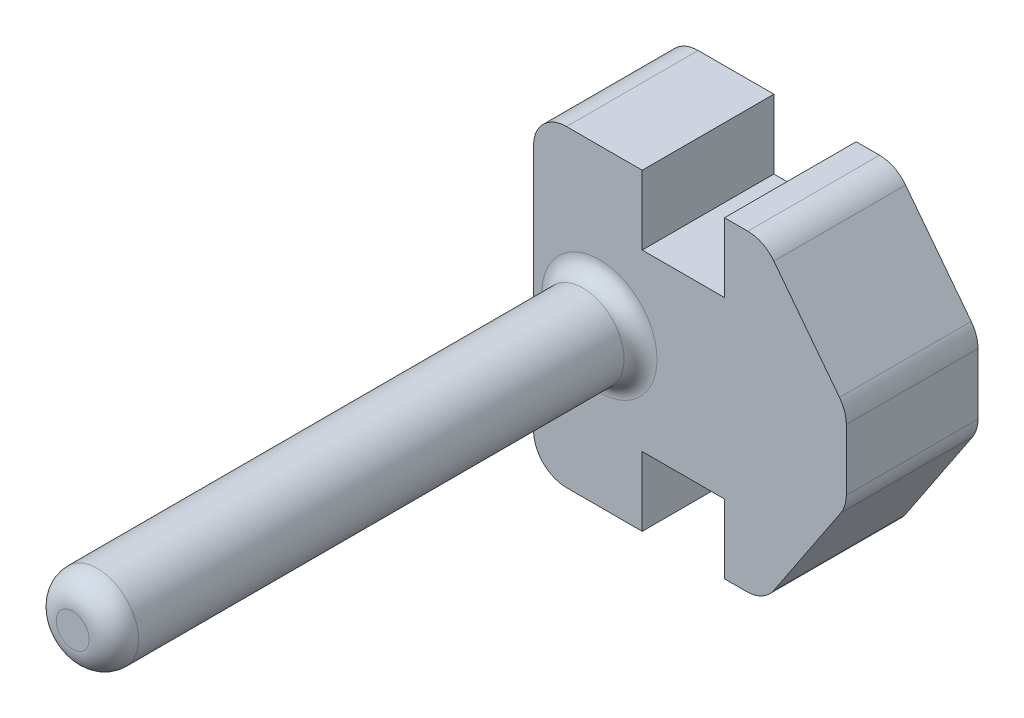
ISO-10303-21;
HEADER;
FILE_DESCRIPTION(('STEP AP214'),'2;1');
FILE_NAME('part.step','',(''),(''),'','','');
FILE_SCHEMA(('AUTOMOTIVE_DESIGN { 1 0 10303 214 1 1 1 1 }'));
ENDSEC;
DATA;
#1=APPLICATION_CONTEXT('core data for automotive mechanical design processes');
#2=APPLICATION_PROTOCOL_DEFINITION('international standard','automotive_design',2000,#1);
#3=PRODUCT_CONTEXT('',#1,'mechanical');
#4=PRODUCT('Part','Part','',(#3));
#5=PRODUCT_RELATED_PRODUCT_CATEGORY('part','',(#4));
#6=PRODUCT_DEFINITION_FORMATION('','',#4);
#7=PRODUCT_DEFINITION_CONTEXT('part definition',#1,'design');
#8=PRODUCT_DEFINITION('design','',#6,#7);
#9=PRODUCT_DEFINITION_SHAPE('','',#8);
#10=(LENGTH_UNIT() NAMED_UNIT(*) SI_UNIT(.MILLI.,.METRE.));
#11=(NAMED_UNIT(*) PLANE_ANGLE_UNIT() SI_UNIT($,.RADIAN.));
#12=(NAMED_UNIT(*) SI_UNIT($,.STERADIAN.) SOLID_ANGLE_UNIT());
#13=UNCERTAINTY_MEASURE_WITH_UNIT(LENGTH_MEASURE(1.E-05),#10,'distance_accuracy_value','');
#14=(GEOMETRIC_REPRESENTATION_CONTEXT(3) GLOBAL_UNCERTAINTY_ASSIGNED_CONTEXT((#13)) GLOBAL_UNIT_ASSIGNED_CONTEXT((#10,
#11,#12)) REPRESENTATION_CONTEXT('',''));
#15=CARTESIAN_POINT('',(0.,0.,0.));
#16=DIRECTION('',(0.,0.,1.));
#17=DIRECTION('',(1.,0.,0.));
#18=AXIS2_PLACEMENT_3D('',#15,#16,#17);
#19=CARTESIAN_POINT('',(2.3,0.,4.));
#20=DIRECTION('',(-1.,0.,0.));
#21=DIRECTION('',(0.,0.,1.));
#22=AXIS2_PLACEMENT_3D('',#19,#20,#21);
#23=PLANE('',#22);
#24=DIRECTION('',(0.,1.,0.));
#25=VECTOR('',#24,1.);
#26=CARTESIAN_POINT('',(2.3,0.,0.));
#27=LINE('',#26,#25);
#28=CARTESIAN_POINT('',(2.3,-4.75,0.));
#29=VERTEX_POINT('',#28);
#30=CARTESIAN_POINT('',(2.3,-2.65,0.));
#31=VERTEX_POINT('',#30);
#32=EDGE_CURVE('E194',#29,#31,#27,.T.);
#33=ORIENTED_EDGE('',*,*,#32,.F.);
#34=DIRECTION('',(0.,0.,-1.));
#35=VECTOR('',#34,1.);
#36=CARTESIAN_POINT('',(2.3,-4.75,4.));
#37=LINE('',#36,#35);
#38=CARTESIAN_POINT('',(2.3,-4.75,4.));
#39=VERTEX_POINT('',#38);
#40=EDGE_CURVE('E181',#39,#29,#37,.T.);
#41=ORIENTED_EDGE('',*,*,#40,.F.);
#42=DIRECTION('',(0.,1.,0.));
#43=VECTOR('',#42,1.);
#44=CARTESIAN_POINT('',(2.3,0.,4.));
#45=LINE('',#44,#43);
#46=CARTESIAN_POINT('',(2.3,-2.65,4.));
#47=VERTEX_POINT('',#46);
#48=EDGE_CURVE('E188',#39,#47,#45,.T.);
#49=ORIENTED_EDGE('',*,*,#48,.T.);
#50=DIRECTION('',(0.,0.,-1.));
#51=VECTOR('',#50,1.);
#52=CARTESIAN_POINT('',(2.3,-2.65,4.));
#53=LINE('',#52,#51);
#54=EDGE_CURVE('E226',#47,#31,#53,.T.);
#55=ORIENTED_EDGE('',*,*,#54,.T.);
#56=EDGE_LOOP('',(#33,#41,#49,#55));
#57=FACE_BOUND('',#56,.T.);
#58=ADVANCED_FACE('F38',(#57),#23,.T.);
#59=CARTESIAN_POINT('',(0.,-4.75,4.));
#60=DIRECTION('',(0.,-1.,0.));
#61=DIRECTION('',(1.,0.,0.));
#62=AXIS2_PLACEMENT_3D('',#59,#60,#61);
#63=PLANE('',#62);
#64=DIRECTION('',(-1.,0.,0.));
#65=VECTOR('',#64,1.);
#66=CARTESIAN_POINT('',(0.,-4.75,0.));
#67=LINE('',#66,#65);
#68=CARTESIAN_POINT('',(2.964816241512,-4.75,0.));
#69=VERTEX_POINT('',#68);
#70=EDGE_CURVE('E228',#69,#29,#67,.T.);
#71=ORIENTED_EDGE('',*,*,#70,.F.);
#72=DIRECTION('',(0.,0.,-1.));
#73=VECTOR('',#72,1.);
#74=CARTESIAN_POINT('',(2.964816241512,-4.75,4.));
#75=LINE('',#74,#73);
#76=CARTESIAN_POINT('',(2.964816241512,-4.75,4.));
#77=VERTEX_POINT('',#76);
#78=EDGE_CURVE('E184',#69,#77,#75,.F.);
#79=ORIENTED_EDGE('',*,*,#78,.T.);
#80=DIRECTION('',(-1.,0.,0.));
#81=VECTOR('',#80,1.);
#82=CARTESIAN_POINT('',(0.,-4.75,4.));
#83=LINE('',#82,#81);
#84=EDGE_CURVE('E177',#77,#39,#83,.T.);
#85=ORIENTED_EDGE('',*,*,#84,.T.);
#86=ORIENTED_EDGE('',*,*,#40,.T.);
#87=EDGE_LOOP('',(#71,#79,#85,#86));
#88=FACE_BOUND('',#87,.T.);
#89=ADVANCED_FACE('F180',(#88),#63,.T.);
#90=CARTESIAN_POINT('',(0.,4.75,4.));
#91=DIRECTION('',(0.,-1.,0.));
#92=DIRECTION('',(0.,0.,-1.));
#93=AXIS2_PLACEMENT_3D('',#90,#91,#92);
#94=PLANE('',#93);
#95=DIRECTION('',(-1.,0.,0.));
#96=VECTOR('',#95,1.);
#97=CARTESIAN_POINT('',(0.,4.75,4.));
#98=LINE('',#97,#96);
#99=CARTESIAN_POINT('',(3.00759850254948,4.75,4.));
#100=VERTEX_POINT('',#99);
#101=CARTESIAN_POINT('',(2.3,4.75,4.));
#102=VERTEX_POINT('',#101);
#103=EDGE_CURVE('E187',#100,#102,#98,.T.);
#104=ORIENTED_EDGE('',*,*,#103,.F.);
#105=DIRECTION('',(0.,0.,-1.));
#106=VECTOR('',#105,1.);
#107=CARTESIAN_POINT('',(3.00759850254948,4.75,0.));
#108=LINE('',#107,#106);
#109=CARTESIAN_POINT('',(3.00759850254948,4.75,0.));
#110=VERTEX_POINT('',#109);
#111=EDGE_CURVE('E299',#100,#110,#108,.T.);
#112=ORIENTED_EDGE('',*,*,#111,.T.);
#113=DIRECTION('',(-1.,0.,0.));
#114=VECTOR('',#113,1.);
#115=CARTESIAN_POINT('',(0.,4.75,0.));
#116=LINE('',#115,#114);
#117=CARTESIAN_POINT('',(2.3,4.75,0.));
#118=VERTEX_POINT('',#117);
#119=EDGE_CURVE('E231',#110,#118,#116,.T.);
#120=ORIENTED_EDGE('',*,*,#119,.T.);
#121=DIRECTION('',(0.,0.,-1.));
#122=VECTOR('',#121,1.);
#123=CARTESIAN_POINT('',(2.3,4.75,4.));
#124=LINE('',#123,#122);
#125=EDGE_CURVE('E196',#102,#118,#124,.T.);
#126=ORIENTED_EDGE('',*,*,#125,.F.);
#127=EDGE_LOOP('',(#104,#112,#120,#126));
#128=FACE_BOUND('',#127,.T.);
#129=ADVANCED_FACE('F336',(#128),#94,.F.);
#130=CARTESIAN_POINT('',(2.3,0.,4.));
#131=DIRECTION('',(1.,0.,0.));
#132=DIRECTION('',(0.,1.,0.));
#133=AXIS2_PLACEMENT_3D('',#130,#131,#132);
#134=PLANE('',#133);
#135=DIRECTION('',(0.,-1.,0.));
#136=VECTOR('',#135,1.);
#137=CARTESIAN_POINT('',(2.3,0.,0.));
#138=LINE('',#137,#136);
#139=CARTESIAN_POINT('',(2.3,2.65,0.));
#140=VERTEX_POINT('',#139);
#141=EDGE_CURVE('E234',#118,#140,#138,.T.);
#142=ORIENTED_EDGE('',*,*,#141,.T.);
#143=DIRECTION('',(0.,0.,-1.));
#144=VECTOR('',#143,1.);
#145=CARTESIAN_POINT('',(2.3,2.65,4.));
#146=LINE('',#145,#144);
#147=CARTESIAN_POINT('',(2.3,2.65,4.));
#148=VERTEX_POINT('',#147);
#149=EDGE_CURVE('E258',#148,#140,#146,.T.);
#150=ORIENTED_EDGE('',*,*,#149,.F.);
#151=DIRECTION('',(0.,-1.,0.));
#152=VECTOR('',#151,1.);
#153=CARTESIAN_POINT('',(2.3,0.,4.));
#154=LINE('',#153,#152);
#155=EDGE_CURVE('E212',#102,#148,#154,.T.);
#156=ORIENTED_EDGE('',*,*,#155,.F.);
#157=ORIENTED_EDGE('',*,*,#125,.T.);
#158=EDGE_LOOP('',(#142,#150,#156,#157));
#159=FACE_BOUND('',#158,.T.);
#160=ADVANCED_FACE('F341',(#159),#134,.F.);
#161=CARTESIAN_POINT('',(0.,2.65,4.));
#162=DIRECTION('',(0.,1.,0.));
#163=DIRECTION('',(0.,0.,1.));
#164=AXIS2_PLACEMENT_3D('',#161,#162,#163);
#165=PLANE('',#164);
#166=DIRECTION('',(1.,0.,0.));
#167=VECTOR('',#166,1.);
#168=CARTESIAN_POINT('',(0.,2.65,0.));
#169=LINE('',#168,#167);
#170=CARTESIAN_POINT('',(-0.2,2.65,0.));
#171=VERTEX_POINT('',#170);
#172=EDGE_CURVE('E238',#171,#140,#169,.T.);
#173=ORIENTED_EDGE('',*,*,#172,.F.);
#174=DIRECTION('',(0.,0.,-1.));
#175=VECTOR('',#174,1.);
#176=CARTESIAN_POINT('',(-0.2,2.65,4.));
#177=LINE('',#176,#175);
#178=CARTESIAN_POINT('',(-0.2,2.65,4.));
#179=VERTEX_POINT('',#178);
#180=EDGE_CURVE('E256',#179,#171,#177,.T.);
#181=ORIENTED_EDGE('',*,*,#180,.F.);
#182=DIRECTION('',(1.,0.,0.));
#183=VECTOR('',#182,1.);
#184=CARTESIAN_POINT('',(0.,2.65,4.));
#185=LINE('',#184,#183);
#186=EDGE_CURVE('E215',#179,#148,#185,.T.);
#187=ORIENTED_EDGE('',*,*,#186,.T.);
#188=ORIENTED_EDGE('',*,*,#149,.T.);
#189=EDGE_LOOP('',(#173,#181,#187,#188));
#190=FACE_BOUND('',#189,.T.);
#191=ADVANCED_FACE('F437',(#190),#165,.T.);
#192=CARTESIAN_POINT('',(-0.2,0.,4.));
#193=DIRECTION('',(1.,0.,0.));
#194=DIRECTION('',(0.,1.,0.));
#195=AXIS2_PLACEMENT_3D('',#192,#193,#194);
#196=PLANE('',#195);
#197=DIRECTION('',(0.,-1.,0.));
#198=VECTOR('',#197,1.);
#199=CARTESIAN_POINT('',(-0.2,0.,0.));
#200=LINE('',#199,#198);
#201=CARTESIAN_POINT('',(-0.2,4.75,0.));
#202=VERTEX_POINT('',#201);
#203=EDGE_CURVE('E241',#202,#171,#200,.T.);
#204=ORIENTED_EDGE('',*,*,#203,.F.);
#205=DIRECTION('',(0.,0.,-1.));
#206=VECTOR('',#205,1.);
#207=CARTESIAN_POINT('',(-0.2,4.75,4.));
#208=LINE('',#207,#206);
#209=CARTESIAN_POINT('',(-0.2,4.75,4.));
#210=VERTEX_POINT('',#209);
#211=EDGE_CURVE('E254',#210,#202,#208,.T.);
#212=ORIENTED_EDGE('',*,*,#211,.F.);
#213=DIRECTION('',(0.,-1.,0.));
#214=VECTOR('',#213,1.);
#215=CARTESIAN_POINT('',(-0.2,0.,4.));
#216=LINE('',#215,#214);
#217=EDGE_CURVE('E218',#210,#179,#216,.T.);
#218=ORIENTED_EDGE('',*,*,#217,.T.);
#219=ORIENTED_EDGE('',*,*,#180,.T.);
#220=EDGE_LOOP('',(#204,#212,#218,#219));
#221=FACE_BOUND('',#220,.T.);
#222=ADVANCED_FACE('F432',(#221),#196,.T.);
#223=CARTESIAN_POINT('',(-2.5,4.75,0.));
#224=VERTEX_POINT('',#223);
#225=EDGE_CURVE('E235',#202,#224,#116,.T.);
#226=ORIENTED_EDGE('',*,*,#225,.T.);
#227=DIRECTION('',(0.,0.,-1.));
#228=VECTOR('',#227,1.);
#229=CARTESIAN_POINT('',(-2.5,4.75,4.));
#230=LINE('',#229,#228);
#231=CARTESIAN_POINT('',(-2.5,4.75,4.));
#232=VERTEX_POINT('',#231);
#233=EDGE_CURVE('E310',#224,#232,#230,.F.);
#234=ORIENTED_EDGE('',*,*,#233,.T.);
#235=EDGE_CURVE('E213',#210,#232,#98,.T.);
#236=ORIENTED_EDGE('',*,*,#235,.F.);
#237=ORIENTED_EDGE('',*,*,#211,.T.);
#238=EDGE_LOOP('',(#226,#234,#236,#237));
#239=FACE_BOUND('',#238,.T.);
#240=ADVANCED_FACE('F436',(#239),#94,.F.);
#241=CARTESIAN_POINT('',(-3.5,0.,4.));
#242=DIRECTION('',(-1.,0.,0.));
#243=DIRECTION('',(0.,0.,1.));
#244=AXIS2_PLACEMENT_3D('',#241,#242,#243);
#245=PLANE('',#244);
#246=DIRECTION('',(0.,1.,0.));
#247=VECTOR('',#246,1.);
#248=CARTESIAN_POINT('',(-3.5,0.,0.));
#249=LINE('',#248,#247);
#250=CARTESIAN_POINT('',(-3.5,-3.75,0.));
#251=VERTEX_POINT('',#250);
#252=CARTESIAN_POINT('',(-3.5,3.75,0.));
#253=VERTEX_POINT('',#252);
#254=EDGE_CURVE('E244',#251,#253,#249,.T.);
#255=ORIENTED_EDGE('',*,*,#254,.F.);
#256=DIRECTION('',(0.,0.,-1.));
#257=VECTOR('',#256,1.);
#258=CARTESIAN_POINT('',(-3.5,-3.75,4.));
#259=LINE('',#258,#257);
#260=CARTESIAN_POINT('',(-3.5,-3.75,4.));
#261=VERTEX_POINT('',#260);
#262=EDGE_CURVE('E308',#251,#261,#259,.F.);
#263=ORIENTED_EDGE('',*,*,#262,.T.);
#264=DIRECTION('',(0.,1.,0.));
#265=VECTOR('',#264,1.);
#266=CARTESIAN_POINT('',(-3.5,0.,4.));
#267=LINE('',#266,#265);
#268=CARTESIAN_POINT('',(-3.5,3.75,4.));
#269=VERTEX_POINT('',#268);
#270=EDGE_CURVE('E221',#261,#269,#267,.T.);
#271=ORIENTED_EDGE('',*,*,#270,.T.);
#272=DIRECTION('',(0.,0.,-1.));
#273=VECTOR('',#272,1.);
#274=CARTESIAN_POINT('',(-3.5,3.75,0.));
#275=LINE('',#274,#273);
#276=EDGE_CURVE('E305',#269,#253,#275,.T.);
#277=ORIENTED_EDGE('',*,*,#276,.T.);
#278=EDGE_LOOP('',(#255,#263,#271,#277));
#279=FACE_BOUND('',#278,.T.);
#280=ADVANCED_FACE('F371',(#279),#245,.T.);
#281=CARTESIAN_POINT('',(-0.200000000000001,-4.75,4.));
#282=VERTEX_POINT('',#281);
#283=CARTESIAN_POINT('',(-2.5,-4.75,4.));
#284=VERTEX_POINT('',#283);
#285=EDGE_CURVE('E190',#282,#284,#83,.T.);
#286=ORIENTED_EDGE('',*,*,#285,.T.);
#287=DIRECTION('',(0.,0.,-1.));
#288=VECTOR('',#287,1.);
#289=CARTESIAN_POINT('',(-2.5,-4.75,4.));
#290=LINE('',#289,#288);
#291=CARTESIAN_POINT('',(-2.5,-4.75,0.));
#292=VERTEX_POINT('',#291);
#293=EDGE_CURVE('E302',#284,#292,#290,.T.);
#294=ORIENTED_EDGE('',*,*,#293,.T.);
#295=CARTESIAN_POINT('',(-0.200000000000001,-4.75,0.));
#296=VERTEX_POINT('',#295);
#297=EDGE_CURVE('E232',#296,#292,#67,.T.);
#298=ORIENTED_EDGE('',*,*,#297,.F.);
#299=DIRECTION('',(0.,0.,-1.));
#300=VECTOR('',#299,1.);
#301=CARTESIAN_POINT('',(-0.200000000000001,-4.75,4.));
#302=LINE('',#301,#300);
#303=EDGE_CURVE('E252',#282,#296,#302,.T.);
#304=ORIENTED_EDGE('',*,*,#303,.F.);
#305=EDGE_LOOP('',(#286,#294,#298,#304));
#306=FACE_BOUND('',#305,.T.);
#307=ADVANCED_FACE('F338',(#306),#63,.T.);
#308=CARTESIAN_POINT('',(-0.200000000000001,0.,4.));
#309=DIRECTION('',(-1.,0.,0.));
#310=DIRECTION('',(0.,0.,1.));
#311=AXIS2_PLACEMENT_3D('',#308,#309,#310);
#312=PLANE('',#311);
#313=DIRECTION('',(0.,1.,0.));
#314=VECTOR('',#313,1.);
#315=CARTESIAN_POINT('',(-0.200000000000001,0.,0.));
#316=LINE('',#315,#314);
#317=CARTESIAN_POINT('',(-0.200000000000001,-2.65,0.));
#318=VERTEX_POINT('',#317);
#319=EDGE_CURVE('E205',#296,#318,#316,.T.);
#320=ORIENTED_EDGE('',*,*,#319,.T.);
#321=DIRECTION('',(0.,0.,-1.));
#322=VECTOR('',#321,1.);
#323=CARTESIAN_POINT('',(-0.200000000000001,-2.65,4.));
#324=LINE('',#323,#322);
#325=CARTESIAN_POINT('',(-0.200000000000001,-2.65,4.));
#326=VERTEX_POINT('',#325);
#327=EDGE_CURVE('E249',#326,#318,#324,.T.);
#328=ORIENTED_EDGE('',*,*,#327,.F.);
#329=DIRECTION('',(0.,1.,0.));
#330=VECTOR('',#329,1.);
#331=CARTESIAN_POINT('',(-0.200000000000001,0.,4.));
#332=LINE('',#331,#330);
#333=EDGE_CURVE('E223',#282,#326,#332,.T.);
#334=ORIENTED_EDGE('',*,*,#333,.F.);
#335=ORIENTED_EDGE('',*,*,#303,.T.);
#336=EDGE_LOOP('',(#320,#328,#334,#335));
#337=FACE_BOUND('',#336,.T.);
#338=ADVANCED_FACE('F386',(#337),#312,.F.);
#339=CARTESIAN_POINT('',(0.,-2.65,4.));
#340=DIRECTION('',(0.,1.,0.));
#341=DIRECTION('',(0.,0.,1.));
#342=AXIS2_PLACEMENT_3D('',#339,#340,#341);
#343=PLANE('',#342);
#344=DIRECTION('',(1.,0.,0.));
#345=VECTOR('',#344,1.);
#346=CARTESIAN_POINT('',(0.,-2.65,0.));
#347=LINE('',#346,#345);
#348=EDGE_CURVE('E202',#318,#31,#347,.T.);
#349=ORIENTED_EDGE('',*,*,#348,.T.);
#350=ORIENTED_EDGE('',*,*,#54,.F.);
#351=DIRECTION('',(1.,0.,0.));
#352=VECTOR('',#351,1.);
#353=CARTESIAN_POINT('',(0.,-2.65,4.));
#354=LINE('',#353,#352);
#355=EDGE_CURVE('E200',#326,#47,#354,.T.);
#356=ORIENTED_EDGE('',*,*,#355,.F.);
#357=ORIENTED_EDGE('',*,*,#327,.T.);
#358=EDGE_LOOP('',(#349,#350,#356,#357));
#359=FACE_BOUND('',#358,.T.);
#360=ADVANCED_FACE('F389',(#359),#343,.F.);
#361=CARTESIAN_POINT('',(0.,0.,4.));
#362=DIRECTION('',(0.,0.,1.));
#363=DIRECTION('',(1.,0.,0.));
#364=AXIS2_PLACEMENT_3D('',#361,#362,#363);
#365=PLANE('',#364);
#366=CARTESIAN_POINT('',(-1.5,0.,4.));
#367=DIRECTION('',(0.,0.,1.));
#368=DIRECTION('',(1.,0.,0.));
#369=AXIS2_PLACEMENT_3D('',#366,#367,#368);
#370=CIRCLE('',#369,1.75);
#371=CARTESIAN_POINT('',(0.25,0.,4.));
#372=VERTEX_POINT('',#371);
#373=EDGE_CURVE('E315',#372,#372,#370,.F.);
#374=ORIENTED_EDGE('',*,*,#373,.T.);
#375=EDGE_LOOP('',(#374));
#376=FACE_BOUND('',#375,.T.);
#377=ORIENTED_EDGE('',*,*,#84,.F.);
#378=CARTESIAN_POINT('',(2.964816241512,-3.75,4.));
#379=DIRECTION('',(0.,0.,1.));
#380=DIRECTION('',(1.,0.,0.));
#381=AXIS2_PLACEMENT_3D('',#378,#379,#380);
#382=CIRCLE('',#381,1.);
#383=CARTESIAN_POINT('',(3.79686653584985,-4.30470019622523,4.));
#384=VERTEX_POINT('',#383);
#385=EDGE_CURVE('E287',#77,#384,#382,.T.);
#386=ORIENTED_EDGE('',*,*,#385,.T.);
#387=DIRECTION('',(-0.554700196225229,-0.832050294337844,0.));
#388=VECTOR('',#387,1.);
#389=CARTESIAN_POINT('',(4.61538461538461,-3.07692307692308,4.));
#390=LINE('',#389,#388);
#391=CARTESIAN_POINT('',(5.83205029433784,-1.25192455849323,4.));
#392=VERTEX_POINT('',#391);
#393=EDGE_CURVE('E393',#392,#384,#390,.T.);
#394=ORIENTED_EDGE('',*,*,#393,.F.);
#395=CARTESIAN_POINT('',(5.,-0.697224362268005,4.));
#396=DIRECTION('',(0.,0.,1.));
#397=DIRECTION('',(1.,0.,0.));
#398=AXIS2_PLACEMENT_3D('',#395,#396,#397);
#399=CIRCLE('',#398,1.);
#400=CARTESIAN_POINT('',(6.,-0.697224362268004,4.));
#401=VERTEX_POINT('',#400);
#402=EDGE_CURVE('E285',#392,#401,#399,.T.);
#403=ORIENTED_EDGE('',*,*,#402,.T.);
#404=DIRECTION('',(0.,-1.,0.));
#405=VECTOR('',#404,1.);
#406=CARTESIAN_POINT('',(6.,0.,4.));
#407=LINE('',#406,#405);
#408=CARTESIAN_POINT('',(6.,1.15987805331433,4.));
#409=VERTEX_POINT('',#408);
#410=EDGE_CURVE('E399',#409,#401,#407,.T.);
#411=ORIENTED_EDGE('',*,*,#410,.F.);
#412=CARTESIAN_POINT('',(5.,1.15987805331433,4.));
#413=DIRECTION('',(0.,0.,1.));
#414=DIRECTION('',(1.,0.,0.));
#415=AXIS2_PLACEMENT_3D('',#412,#413,#414);
#416=CIRCLE('',#415,1.);
#417=CARTESIAN_POINT('',(5.7926239891046,1.76958881416402,4.));
#418=VERTEX_POINT('',#417);
#419=EDGE_CURVE('E283',#409,#418,#416,.T.);
#420=ORIENTED_EDGE('',*,*,#419,.T.);
#421=DIRECTION('',(0.609710760849692,-0.7926239891046,0.));
#422=VECTOR('',#421,1.);
#423=CARTESIAN_POINT('',(4.49442379182156,3.45724907063197,4.));
#424=LINE('',#423,#422);
#425=CARTESIAN_POINT('',(3.80022249165408,4.35971076084969,4.));
#426=VERTEX_POINT('',#425);
#427=EDGE_CURVE('E229',#426,#418,#424,.T.);
#428=ORIENTED_EDGE('',*,*,#427,.F.);
#429=CARTESIAN_POINT('',(3.00759850254948,3.75,4.));
#430=DIRECTION('',(0.,0.,1.));
#431=DIRECTION('',(1.,0.,0.));
#432=AXIS2_PLACEMENT_3D('',#429,#430,#431);
#433=CIRCLE('',#432,1.);
#434=EDGE_CURVE('E281',#426,#100,#433,.T.);
#435=ORIENTED_EDGE('',*,*,#434,.T.);
#436=ORIENTED_EDGE('',*,*,#103,.T.);
#437=ORIENTED_EDGE('',*,*,#155,.T.);
#438=ORIENTED_EDGE('',*,*,#186,.F.);
#439=ORIENTED_EDGE('',*,*,#217,.F.);
#440=ORIENTED_EDGE('',*,*,#235,.T.);
#441=CARTESIAN_POINT('',(-2.5,3.75,4.));
#442=DIRECTION('',(0.,0.,1.));
#443=DIRECTION('',(1.,0.,0.));
#444=AXIS2_PLACEMENT_3D('',#441,#442,#443);
#445=CIRCLE('',#444,1.);
#446=EDGE_CURVE('E59',#232,#269,#445,.T.);
#447=ORIENTED_EDGE('',*,*,#446,.T.);
#448=ORIENTED_EDGE('',*,*,#270,.F.);
#449=CARTESIAN_POINT('',(-2.5,-3.75,4.));
#450=DIRECTION('',(0.,0.,1.));
#451=DIRECTION('',(1.,0.,0.));
#452=AXIS2_PLACEMENT_3D('',#449,#450,#451);
#453=CIRCLE('',#452,1.);
#454=EDGE_CURVE('E53',#261,#284,#453,.T.);
#455=ORIENTED_EDGE('',*,*,#454,.T.);
#456=ORIENTED_EDGE('',*,*,#285,.F.);
#457=ORIENTED_EDGE('',*,*,#333,.T.);
#458=ORIENTED_EDGE('',*,*,#355,.T.);
#459=ORIENTED_EDGE('',*,*,#48,.F.);
#460=EDGE_LOOP('',(#377,#386,#394,#403,#411,#420,#428,#435,#436,#437,#438,#439,#440,#447,#448,
#455,#456,#457,#458,#459));
#461=FACE_BOUND('',#460,.T.);
#462=ADVANCED_FACE('F198',(#376,#461),#365,.T.);
#463=CARTESIAN_POINT('',(0.,0.,0.));
#464=DIRECTION('',(0.,0.,1.));
#465=DIRECTION('',(1.,0.,0.));
#466=AXIS2_PLACEMENT_3D('',#463,#464,#465);
#467=PLANE('',#466);
#468=DIRECTION('',(-0.554700196225229,-0.832050294337844,0.));
#469=VECTOR('',#468,1.);
#470=CARTESIAN_POINT('',(4.61538461538461,-3.07692307692308,0.));
#471=LINE('',#470,#469);
#472=CARTESIAN_POINT('',(5.83205029433784,-1.25192455849323,0.));
#473=VERTEX_POINT('',#472);
#474=CARTESIAN_POINT('',(3.79686653584985,-4.30470019622523,0.));
#475=VERTEX_POINT('',#474);
#476=EDGE_CURVE('E408',#473,#475,#471,.T.);
#477=ORIENTED_EDGE('',*,*,#476,.T.);
#478=CARTESIAN_POINT('',(2.964816241512,-3.75,0.));
#479=DIRECTION('',(0.,0.,1.));
#480=DIRECTION('',(1.,0.,0.));
#481=AXIS2_PLACEMENT_3D('',#478,#479,#480);
#482=CIRCLE('',#481,1.);
#483=EDGE_CURVE('E276',#475,#69,#482,.F.);
#484=ORIENTED_EDGE('',*,*,#483,.T.);
#485=ORIENTED_EDGE('',*,*,#70,.T.);
#486=ORIENTED_EDGE('',*,*,#32,.T.);
#487=ORIENTED_EDGE('',*,*,#348,.F.);
#488=ORIENTED_EDGE('',*,*,#319,.F.);
#489=ORIENTED_EDGE('',*,*,#297,.T.);
#490=CARTESIAN_POINT('',(-2.5,-3.75,0.));
#491=DIRECTION('',(0.,0.,1.));
#492=DIRECTION('',(1.,0.,0.));
#493=AXIS2_PLACEMENT_3D('',#490,#491,#492);
#494=CIRCLE('',#493,1.);
#495=EDGE_CURVE('E268',#292,#251,#494,.F.);
#496=ORIENTED_EDGE('',*,*,#495,.T.);
#497=ORIENTED_EDGE('',*,*,#254,.T.);
#498=CARTESIAN_POINT('',(-2.5,3.75,0.));
#499=DIRECTION('',(0.,0.,1.));
#500=DIRECTION('',(1.,0.,0.));
#501=AXIS2_PLACEMENT_3D('',#498,#499,#500);
#502=CIRCLE('',#501,1.);
#503=EDGE_CURVE('E266',#253,#224,#502,.F.);
#504=ORIENTED_EDGE('',*,*,#503,.T.);
#505=ORIENTED_EDGE('',*,*,#225,.F.);
#506=ORIENTED_EDGE('',*,*,#203,.T.);
#507=ORIENTED_EDGE('',*,*,#172,.T.);
#508=ORIENTED_EDGE('',*,*,#141,.F.);
#509=ORIENTED_EDGE('',*,*,#119,.F.);
#510=CARTESIAN_POINT('',(3.00759850254948,3.75,0.));
#511=DIRECTION('',(0.,0.,1.));
#512=DIRECTION('',(1.,0.,0.));
#513=AXIS2_PLACEMENT_3D('',#510,#511,#512);
#514=CIRCLE('',#513,1.);
#515=CARTESIAN_POINT('',(3.80022249165408,4.35971076084969,0.));
#516=VERTEX_POINT('',#515);
#517=EDGE_CURVE('E270',#110,#516,#514,.F.);
#518=ORIENTED_EDGE('',*,*,#517,.T.);
#519=DIRECTION('',(0.609710760849692,-0.7926239891046,0.));
#520=VECTOR('',#519,1.);
#521=CARTESIAN_POINT('',(4.49442379182156,3.45724907063197,0.));
#522=LINE('',#521,#520);
#523=CARTESIAN_POINT('',(5.7926239891046,1.76958881416402,0.));
#524=VERTEX_POINT('',#523);
#525=EDGE_CURVE('E208',#516,#524,#522,.T.);
#526=ORIENTED_EDGE('',*,*,#525,.T.);
#527=CARTESIAN_POINT('',(5.,1.15987805331433,0.));
#528=DIRECTION('',(0.,0.,1.));
#529=DIRECTION('',(1.,0.,0.));
#530=AXIS2_PLACEMENT_3D('',#527,#528,#529);
#531=CIRCLE('',#530,1.);
#532=CARTESIAN_POINT('',(6.,1.15987805331433,0.));
#533=VERTEX_POINT('',#532);
#534=EDGE_CURVE('E272',#524,#533,#531,.F.);
#535=ORIENTED_EDGE('',*,*,#534,.T.);
#536=DIRECTION('',(0.,-1.,0.));
#537=VECTOR('',#536,1.);
#538=CARTESIAN_POINT('',(6.,0.,0.));
#539=LINE('',#538,#537);
#540=CARTESIAN_POINT('',(6.,-0.697224362268004,0.));
#541=VERTEX_POINT('',#540);
#542=EDGE_CURVE('E406',#533,#541,#539,.T.);
#543=ORIENTED_EDGE('',*,*,#542,.T.);
#544=CARTESIAN_POINT('',(5.,-0.697224362268005,0.));
#545=DIRECTION('',(0.,0.,1.));
#546=DIRECTION('',(1.,0.,0.));
#547=AXIS2_PLACEMENT_3D('',#544,#545,#546);
#548=CIRCLE('',#547,1.);
#549=EDGE_CURVE('E274',#541,#473,#548,.F.);
#550=ORIENTED_EDGE('',*,*,#549,.T.);
#551=EDGE_LOOP('',(#477,#484,#485,#486,#487,#488,#489,#496,#497,#504,#505,#506,#507,#508,#509,
#518,#526,#535,#543,#550));
#552=FACE_BOUND('',#551,.T.);
#553=ADVANCED_FACE('F375',(#552),#467,.F.);
#554=CARTESIAN_POINT('',(6.,0.,4.));
#555=DIRECTION('',(1.,0.,0.));
#556=DIRECTION('',(0.,1.,0.));
#557=AXIS2_PLACEMENT_3D('',#554,#555,#556);
#558=PLANE('',#557);
#559=ORIENTED_EDGE('',*,*,#410,.T.);
#560=DIRECTION('',(0.,0.,-1.));
#561=VECTOR('',#560,1.);
#562=CARTESIAN_POINT('',(6.,-0.697224362268004,4.));
#563=LINE('',#562,#561);
#564=EDGE_CURVE('E291',#401,#541,#563,.T.);
#565=ORIENTED_EDGE('',*,*,#564,.T.);
#566=ORIENTED_EDGE('',*,*,#542,.F.);
#567=DIRECTION('',(0.,0.,-1.));
#568=VECTOR('',#567,1.);
#569=CARTESIAN_POINT('',(6.,1.15987805331433,4.));
#570=LINE('',#569,#568);
#571=EDGE_CURVE('E289',#533,#409,#570,.F.);
#572=ORIENTED_EDGE('',*,*,#571,.T.);
#573=EDGE_LOOP('',(#559,#565,#566,#572));
#574=FACE_BOUND('',#573,.T.);
#575=ADVANCED_FACE('F456',(#574),#558,.T.);
#576=CARTESIAN_POINT('',(4.49442379182156,3.45724907063197,4.));
#577=DIRECTION('',(0.7926239891046,0.609710760849692,0.));
#578=DIRECTION('',(-0.609710760849692,0.7926239891046,0.));
#579=AXIS2_PLACEMENT_3D('',#576,#577,#578);
#580=PLANE('',#579);
#581=ORIENTED_EDGE('',*,*,#427,.T.);
#582=DIRECTION('',(0.,0.,-1.));
#583=VECTOR('',#582,1.);
#584=CARTESIAN_POINT('',(5.7926239891046,1.76958881416402,4.));
#585=LINE('',#584,#583);
#586=EDGE_CURVE('E296',#418,#524,#585,.T.);
#587=ORIENTED_EDGE('',*,*,#586,.T.);
#588=ORIENTED_EDGE('',*,*,#525,.F.);
#589=DIRECTION('',(0.,0.,-1.));
#590=VECTOR('',#589,1.);
#591=CARTESIAN_POINT('',(3.80022249165408,4.35971076084969,4.));
#592=LINE('',#591,#590);
#593=EDGE_CURVE('E294',#516,#426,#592,.F.);
#594=ORIENTED_EDGE('',*,*,#593,.T.);
#595=EDGE_LOOP('',(#581,#587,#588,#594));
#596=FACE_BOUND('',#595,.T.);
#597=ADVANCED_FACE('F415',(#596),#580,.T.);
#598=CARTESIAN_POINT('',(4.61538461538461,-3.07692307692308,4.));
#599=DIRECTION('',(0.832050294337843,-0.554700196225229,0.));
#600=DIRECTION('',(0.554700196225229,0.832050294337844,0.));
#601=AXIS2_PLACEMENT_3D('',#598,#599,#600);
#602=PLANE('',#601);
#603=ORIENTED_EDGE('',*,*,#393,.T.);
#604=DIRECTION('',(0.,0.,-1.));
#605=VECTOR('',#604,1.);
#606=CARTESIAN_POINT('',(3.79686653584985,-4.30470019622523,4.));
#607=LINE('',#606,#605);
#608=EDGE_CURVE('E263',#384,#475,#607,.T.);
#609=ORIENTED_EDGE('',*,*,#608,.T.);
#610=ORIENTED_EDGE('',*,*,#476,.F.);
#611=DIRECTION('',(0.,0.,-1.));
#612=VECTOR('',#611,1.);
#613=CARTESIAN_POINT('',(5.83205029433784,-1.25192455849323,4.));
#614=LINE('',#613,#612);
#615=EDGE_CURVE('E195',#473,#392,#614,.F.);
#616=ORIENTED_EDGE('',*,*,#615,.T.);
#617=EDGE_LOOP('',(#603,#609,#610,#616));
#618=FACE_BOUND('',#617,.T.);
#619=ADVANCED_FACE('F396',(#618),#602,.T.);
#620=CARTESIAN_POINT('',(-1.5,0.,20.));
#621=DIRECTION('',(0.,0.,-1.));
#622=DIRECTION('',(-1.,0.,0.));
#623=AXIS2_PLACEMENT_3D('',#620,#621,#622);
#624=CYLINDRICAL_SURFACE('',#623,1.25);
#625=CARTESIAN_POINT('',(-1.5,0.,19.25));
#626=DIRECTION('',(0.,0.,1.));
#627=DIRECTION('',(1.,0.,0.));
#628=AXIS2_PLACEMENT_3D('',#625,#626,#627);
#629=CIRCLE('',#628,1.25);
#630=CARTESIAN_POINT('',(-0.25,0.,19.25));
#631=VERTEX_POINT('',#630);
#632=EDGE_CURVE('E11',#631,#631,#629,.F.);
#633=ORIENTED_EDGE('',*,*,#632,.T.);
#634=EDGE_LOOP('',(#633));
#635=FACE_BOUND('',#634,.T.);
#636=CARTESIAN_POINT('',(-1.5,0.,4.5));
#637=DIRECTION('',(0.,0.,1.));
#638=DIRECTION('',(1.,0.,0.));
#639=AXIS2_PLACEMENT_3D('',#636,#637,#638);
#640=CIRCLE('',#639,1.25);
#641=CARTESIAN_POINT('',(-0.25,0.,4.5));
#642=VERTEX_POINT('',#641);
#643=EDGE_CURVE('E312',#642,#642,#640,.T.);
#644=ORIENTED_EDGE('',*,*,#643,.T.);
#645=EDGE_LOOP('',(#644));
#646=FACE_BOUND('',#645,.T.);
#647=ADVANCED_FACE('F465',(#635,#646),#624,.T.);
#648=CARTESIAN_POINT('',(0.,0.,20.));
#649=DIRECTION('',(0.,0.,1.));
#650=DIRECTION('',(1.,0.,0.));
#651=AXIS2_PLACEMENT_3D('',#648,#649,#650);
#652=PLANE('',#651);
#653=CARTESIAN_POINT('',(-1.5,0.,20.));
#654=DIRECTION('',(0.,0.,1.));
#655=DIRECTION('',(1.,0.,0.));
#656=AXIS2_PLACEMENT_3D('',#653,#654,#655);
#657=CIRCLE('',#656,0.5);
#658=CARTESIAN_POINT('',(-1.,0.,20.));
#659=VERTEX_POINT('',#658);
#660=EDGE_CURVE('E46',#659,#659,#657,.T.);
#661=ORIENTED_EDGE('',*,*,#660,.T.);
#662=EDGE_LOOP('',(#661));
#663=FACE_BOUND('',#662,.T.);
#664=ADVANCED_FACE('F320',(#663),#652,.T.);
#665=CARTESIAN_POINT('',(2.964816241512,-3.75,4.));
#666=DIRECTION('',(0.,0.,-1.));
#667=DIRECTION('',(-1.,0.,0.));
#668=AXIS2_PLACEMENT_3D('',#665,#666,#667);
#669=CYLINDRICAL_SURFACE('',#668,1.);
#670=ORIENTED_EDGE('',*,*,#385,.F.);
#671=ORIENTED_EDGE('',*,*,#78,.F.);
#672=ORIENTED_EDGE('',*,*,#483,.F.);
#673=ORIENTED_EDGE('',*,*,#608,.F.);
#674=EDGE_LOOP('',(#670,#671,#672,#673));
#675=FACE_BOUND('',#674,.T.);
#676=ADVANCED_FACE('F343',(#675),#669,.T.);
#677=CARTESIAN_POINT('',(5.,-0.697224362268005,4.));
#678=DIRECTION('',(0.,0.,-1.));
#679=DIRECTION('',(-1.,0.,0.));
#680=AXIS2_PLACEMENT_3D('',#677,#678,#679);
#681=CYLINDRICAL_SURFACE('',#680,1.);
#682=ORIENTED_EDGE('',*,*,#402,.F.);
#683=ORIENTED_EDGE('',*,*,#615,.F.);
#684=ORIENTED_EDGE('',*,*,#549,.F.);
#685=ORIENTED_EDGE('',*,*,#564,.F.);
#686=EDGE_LOOP('',(#682,#683,#684,#685));
#687=FACE_BOUND('',#686,.T.);
#688=ADVANCED_FACE('F346',(#687),#681,.T.);
#689=CARTESIAN_POINT('',(5.,1.15987805331433,4.));
#690=DIRECTION('',(0.,0.,-1.));
#691=DIRECTION('',(-1.,0.,0.));
#692=AXIS2_PLACEMENT_3D('',#689,#690,#691);
#693=CYLINDRICAL_SURFACE('',#692,1.);
#694=ORIENTED_EDGE('',*,*,#419,.F.);
#695=ORIENTED_EDGE('',*,*,#571,.F.);
#696=ORIENTED_EDGE('',*,*,#534,.F.);
#697=ORIENTED_EDGE('',*,*,#586,.F.);
#698=EDGE_LOOP('',(#694,#695,#696,#697));
#699=FACE_BOUND('',#698,.T.);
#700=ADVANCED_FACE('F350',(#699),#693,.T.);
#701=CARTESIAN_POINT('',(3.00759850254948,3.75,4.));
#702=DIRECTION('',(0.,0.,1.));
#703=DIRECTION('',(1.,0.,0.));
#704=AXIS2_PLACEMENT_3D('',#701,#702,#703);
#705=CYLINDRICAL_SURFACE('',#704,1.);
#706=ORIENTED_EDGE('',*,*,#434,.F.);
#707=ORIENTED_EDGE('',*,*,#593,.F.);
#708=ORIENTED_EDGE('',*,*,#517,.F.);
#709=ORIENTED_EDGE('',*,*,#111,.F.);
#710=EDGE_LOOP('',(#706,#707,#708,#709));
#711=FACE_BOUND('',#710,.T.);
#712=ADVANCED_FACE('F354',(#711),#705,.T.);
#713=CARTESIAN_POINT('',(-2.5,-3.75,4.));
#714=DIRECTION('',(0.,0.,-1.));
#715=DIRECTION('',(-1.,0.,0.));
#716=AXIS2_PLACEMENT_3D('',#713,#714,#715);
#717=CYLINDRICAL_SURFACE('',#716,1.);
#718=ORIENTED_EDGE('',*,*,#454,.F.);
#719=ORIENTED_EDGE('',*,*,#262,.F.);
#720=ORIENTED_EDGE('',*,*,#495,.F.);
#721=ORIENTED_EDGE('',*,*,#293,.F.);
#722=EDGE_LOOP('',(#718,#719,#720,#721));
#723=FACE_BOUND('',#722,.T.);
#724=ADVANCED_FACE('F358',(#723),#717,.T.);
#725=CARTESIAN_POINT('',(-2.5,3.75,4.));
#726=DIRECTION('',(0.,0.,1.));
#727=DIRECTION('',(1.,0.,0.));
#728=AXIS2_PLACEMENT_3D('',#725,#726,#727);
#729=CYLINDRICAL_SURFACE('',#728,1.);
#730=ORIENTED_EDGE('',*,*,#446,.F.);
#731=ORIENTED_EDGE('',*,*,#233,.F.);
#732=ORIENTED_EDGE('',*,*,#503,.F.);
#733=ORIENTED_EDGE('',*,*,#276,.F.);
#734=EDGE_LOOP('',(#730,#731,#732,#733));
#735=FACE_BOUND('',#734,.T.);
#736=ADVANCED_FACE('F328',(#735),#729,.T.);
#737=CARTESIAN_POINT('',(-1.5,0.,4.5));
#738=DIRECTION('',(0.,0.,1.));
#739=DIRECTION('',(1.,0.,0.));
#740=AXIS2_PLACEMENT_3D('',#737,#738,#739);
#741=TOROIDAL_SURFACE('',#740,1.75,0.5);
#742=ORIENTED_EDGE('',*,*,#373,.F.);
#743=EDGE_LOOP('',(#742));
#744=FACE_BOUND('',#743,.T.);
#745=ORIENTED_EDGE('',*,*,#643,.F.);
#746=EDGE_LOOP('',(#745));
#747=FACE_BOUND('',#746,.T.);
#748=ADVANCED_FACE('F323',(#744,#747),#741,.F.);
#749=CARTESIAN_POINT('',(-1.5,0.,19.25));
#750=DIRECTION('',(0.,0.,1.));
#751=DIRECTION('',(1.,0.,0.));
#752=AXIS2_PLACEMENT_3D('',#749,#750,#751);
#753=DEGENERATE_TOROIDAL_SURFACE('',#752,0.5,0.75,.T.);
#754=ORIENTED_EDGE('',*,*,#632,.F.);
#755=EDGE_LOOP('',(#754));
#756=FACE_BOUND('',#755,.T.);
#757=ORIENTED_EDGE('',*,*,#660,.F.);
#758=EDGE_LOOP('',(#757));
#759=FACE_BOUND('',#758,.T.);
#760=ADVANCED_FACE('F40',(#756,#759),#753,.T.);
#761=CLOSED_SHELL('',(#58,#89,#129,#160,#191,#222,#240,#280,#307,#338,#360,#462,#553,#575,#597,
#619,#647,#664,#676,#688,#700,#712,#724,#736,#748,#760));
#762=MANIFOLD_SOLID_BREP('B2',#761);
#763=ADVANCED_BREP_SHAPE_REPRESENTATION('',(#18,#762),#14);
#764=SHAPE_DEFINITION_REPRESENTATION(#9,#763);
ENDSEC;
END-ISO-10303-21;
